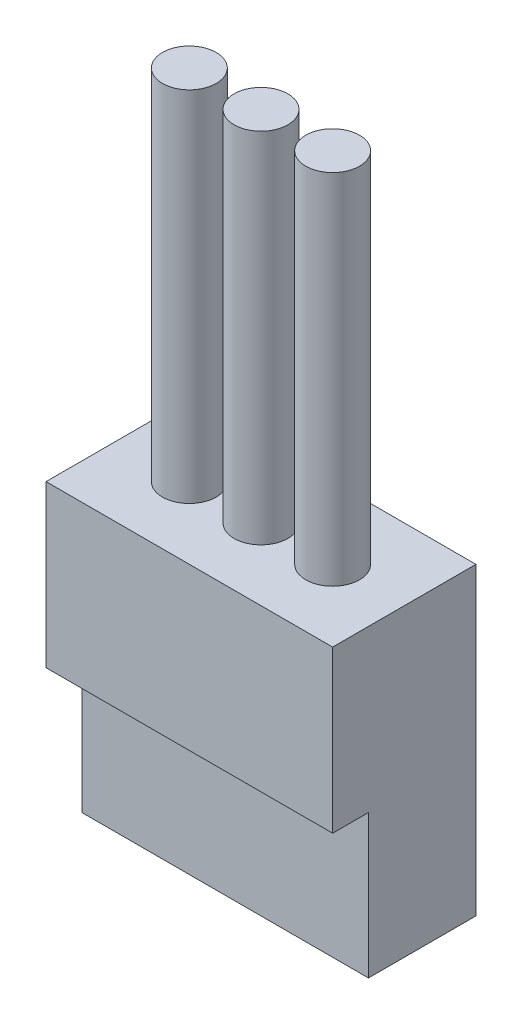
ISO-10303-21;
HEADER;
FILE_DESCRIPTION(('STEP AP214'),'2;1');
FILE_NAME('part.step','',(''),(''),'','','');
FILE_SCHEMA(('AUTOMOTIVE_DESIGN { 1 0 10303 214 1 1 1 1 }'));
ENDSEC;
DATA;
#1=APPLICATION_CONTEXT('core data for automotive mechanical design processes');
#2=APPLICATION_PROTOCOL_DEFINITION('international standard','automotive_design',2000,#1);
#3=PRODUCT_CONTEXT('',#1,'mechanical');
#4=PRODUCT('Part','Part','',(#3));
#5=PRODUCT_RELATED_PRODUCT_CATEGORY('part','',(#4));
#6=PRODUCT_DEFINITION_FORMATION('','',#4);
#7=PRODUCT_DEFINITION_CONTEXT('part definition',#1,'design');
#8=PRODUCT_DEFINITION('design','',#6,#7);
#9=PRODUCT_DEFINITION_SHAPE('','',#8);
#10=(LENGTH_UNIT() NAMED_UNIT(*) SI_UNIT(.MILLI.,.METRE.));
#11=(NAMED_UNIT(*) PLANE_ANGLE_UNIT() SI_UNIT($,.RADIAN.));
#12=(NAMED_UNIT(*) SI_UNIT($,.STERADIAN.) SOLID_ANGLE_UNIT());
#13=UNCERTAINTY_MEASURE_WITH_UNIT(LENGTH_MEASURE(1.E-05),#10,'distance_accuracy_value','');
#14=(GEOMETRIC_REPRESENTATION_CONTEXT(3) GLOBAL_UNCERTAINTY_ASSIGNED_CONTEXT((#13)) GLOBAL_UNIT_ASSIGNED_CONTEXT((#10,
#11,#12)) REPRESENTATION_CONTEXT('',''));
#15=CARTESIAN_POINT('',(0.,0.,0.));
#16=DIRECTION('',(0.,0.,1.));
#17=DIRECTION('',(1.,0.,0.));
#18=AXIS2_PLACEMENT_3D('',#15,#16,#17);
#19=CARTESIAN_POINT('',(0.,8.5,4.));
#20=DIRECTION('',(0.,1.,0.));
#21=DIRECTION('',(0.,0.,1.));
#22=AXIS2_PLACEMENT_3D('',#19,#20,#21);
#23=PLANE('',#22);
#24=CARTESIAN_POINT('',(2.,8.5,2.));
#25=DIRECTION('',(0.,1.,0.));
#26=DIRECTION('',(0.,0.,1.));
#27=AXIS2_PLACEMENT_3D('',#24,#25,#26);
#28=CIRCLE('',#27,0.75);
#29=CARTESIAN_POINT('',(2.,8.5,2.75));
#30=VERTEX_POINT('',#29);
#31=EDGE_CURVE('E160',#30,#30,#28,.T.);
#32=ORIENTED_EDGE('',*,*,#31,.F.);
#33=EDGE_LOOP('',(#32));
#34=FACE_BOUND('',#33,.T.);
#35=DIRECTION('',(0.,0.,1.));
#36=VECTOR('',#35,1.);
#37=CARTESIAN_POINT('',(0.,8.5,0.));
#38=LINE('',#37,#36);
#39=CARTESIAN_POINT('',(0.,8.5,0.));
#40=VERTEX_POINT('',#39);
#41=CARTESIAN_POINT('',(0.,8.5,4.));
#42=VERTEX_POINT('',#41);
#43=EDGE_CURVE('E113',#40,#42,#38,.T.);
#44=ORIENTED_EDGE('',*,*,#43,.T.);
#45=DIRECTION('',(1.,0.,0.));
#46=VECTOR('',#45,1.);
#47=CARTESIAN_POINT('',(0.,8.5,4.));
#48=LINE('',#47,#46);
#49=CARTESIAN_POINT('',(8.,8.5,4.));
#50=VERTEX_POINT('',#49);
#51=EDGE_CURVE('E124',#42,#50,#48,.T.);
#52=ORIENTED_EDGE('',*,*,#51,.T.);
#53=DIRECTION('',(0.,0.,-1.));
#54=VECTOR('',#53,1.);
#55=CARTESIAN_POINT('',(8.,8.5,0.));
#56=LINE('',#55,#54);
#57=CARTESIAN_POINT('',(8.,8.5,0.));
#58=VERTEX_POINT('',#57);
#59=EDGE_CURVE('E119',#50,#58,#56,.T.);
#60=ORIENTED_EDGE('',*,*,#59,.T.);
#61=DIRECTION('',(-1.,0.,0.));
#62=VECTOR('',#61,1.);
#63=CARTESIAN_POINT('',(0.,8.5,0.));
#64=LINE('',#63,#62);
#65=EDGE_CURVE('E83',#58,#40,#64,.T.);
#66=ORIENTED_EDGE('',*,*,#65,.T.);
#67=EDGE_LOOP('',(#44,#52,#60,#66));
#68=FACE_BOUND('',#67,.T.);
#69=CARTESIAN_POINT('',(4.,8.5,2.));
#70=DIRECTION('',(0.,1.,0.));
#71=DIRECTION('',(0.,0.,1.));
#72=AXIS2_PLACEMENT_3D('',#69,#70,#71);
#73=CIRCLE('',#72,0.75);
#74=CARTESIAN_POINT('',(4.,8.5,2.75));
#75=VERTEX_POINT('',#74);
#76=EDGE_CURVE('E154',#75,#75,#73,.T.);
#77=ORIENTED_EDGE('',*,*,#76,.F.);
#78=EDGE_LOOP('',(#77));
#79=FACE_BOUND('',#78,.T.);
#80=CARTESIAN_POINT('',(6.,8.5,2.));
#81=DIRECTION('',(0.,1.,0.));
#82=DIRECTION('',(0.,0.,-1.));
#83=AXIS2_PLACEMENT_3D('',#80,#81,#82);
#84=CIRCLE('',#83,0.749999999999998);
#85=CARTESIAN_POINT('',(6.,8.5,1.25));
#86=VERTEX_POINT('',#85);
#87=EDGE_CURVE('E166',#86,#86,#84,.T.);
#88=ORIENTED_EDGE('',*,*,#87,.F.);
#89=EDGE_LOOP('',(#88));
#90=FACE_BOUND('',#89,.T.);
#91=ADVANCED_FACE('F30',(#34,#68,#79,#90),#23,.T.);
#92=CARTESIAN_POINT('',(0.,4.,3.));
#93=DIRECTION('',(1.,0.,0.));
#94=DIRECTION('',(0.,0.,-1.));
#95=AXIS2_PLACEMENT_3D('',#92,#93,#94);
#96=PLANE('',#95);
#97=DIRECTION('',(0.,0.,1.));
#98=VECTOR('',#97,1.);
#99=CARTESIAN_POINT('',(0.,0.,3.));
#100=LINE('',#99,#98);
#101=CARTESIAN_POINT('',(0.,0.,0.));
#102=VERTEX_POINT('',#101);
#103=CARTESIAN_POINT('',(0.,0.,3.));
#104=VERTEX_POINT('',#103);
#105=EDGE_CURVE('E89',#102,#104,#100,.T.);
#106=ORIENTED_EDGE('',*,*,#105,.T.);
#107=DIRECTION('',(0.,-1.,0.));
#108=VECTOR('',#107,1.);
#109=CARTESIAN_POINT('',(0.,4.,3.));
#110=LINE('',#109,#108);
#111=CARTESIAN_POINT('',(0.,4.,3.));
#112=VERTEX_POINT('',#111);
#113=EDGE_CURVE('E11',#112,#104,#110,.T.);
#114=ORIENTED_EDGE('',*,*,#113,.F.);
#115=DIRECTION('',(0.,0.,1.));
#116=VECTOR('',#115,1.);
#117=CARTESIAN_POINT('',(0.,4.,0.));
#118=LINE('',#117,#116);
#119=CARTESIAN_POINT('',(0.,4.,4.));
#120=VERTEX_POINT('',#119);
#121=EDGE_CURVE('E131',#112,#120,#118,.T.);
#122=ORIENTED_EDGE('',*,*,#121,.T.);
#123=DIRECTION('',(0.,-1.,0.));
#124=VECTOR('',#123,1.);
#125=CARTESIAN_POINT('',(0.,8.5,4.));
#126=LINE('',#125,#124);
#127=EDGE_CURVE('E104',#42,#120,#126,.T.);
#128=ORIENTED_EDGE('',*,*,#127,.F.);
#129=ORIENTED_EDGE('',*,*,#43,.F.);
#130=DIRECTION('',(0.,-1.,0.));
#131=VECTOR('',#130,1.);
#132=CARTESIAN_POINT('',(0.,4.,0.));
#133=LINE('',#132,#131);
#134=EDGE_CURVE('E84',#40,#102,#133,.T.);
#135=ORIENTED_EDGE('',*,*,#134,.T.);
#136=EDGE_LOOP('',(#106,#114,#122,#128,#129,#135));
#137=FACE_BOUND('',#136,.T.);
#138=ADVANCED_FACE('F32',(#137),#96,.F.);
#139=CARTESIAN_POINT('',(8.,4.,3.));
#140=DIRECTION('',(0.,0.,-1.));
#141=DIRECTION('',(-1.,0.,0.));
#142=AXIS2_PLACEMENT_3D('',#139,#140,#141);
#143=PLANE('',#142);
#144=DIRECTION('',(1.,0.,0.));
#145=VECTOR('',#144,1.);
#146=CARTESIAN_POINT('',(8.,0.,3.));
#147=LINE('',#146,#145);
#148=CARTESIAN_POINT('',(8.,0.,3.));
#149=VERTEX_POINT('',#148);
#150=EDGE_CURVE('E75',#104,#149,#147,.T.);
#151=ORIENTED_EDGE('',*,*,#150,.T.);
#152=DIRECTION('',(0.,-1.,0.));
#153=VECTOR('',#152,1.);
#154=CARTESIAN_POINT('',(8.,4.,3.));
#155=LINE('',#154,#153);
#156=CARTESIAN_POINT('',(8.,4.,3.));
#157=VERTEX_POINT('',#156);
#158=EDGE_CURVE('E40',#157,#149,#155,.T.);
#159=ORIENTED_EDGE('',*,*,#158,.F.);
#160=DIRECTION('',(1.,0.,0.));
#161=VECTOR('',#160,1.);
#162=CARTESIAN_POINT('',(8.,4.,3.));
#163=LINE('',#162,#161);
#164=EDGE_CURVE('E46',#112,#157,#163,.T.);
#165=ORIENTED_EDGE('',*,*,#164,.F.);
#166=ORIENTED_EDGE('',*,*,#113,.T.);
#167=EDGE_LOOP('',(#151,#159,#165,#166));
#168=FACE_BOUND('',#167,.T.);
#169=ADVANCED_FACE('F105',(#168),#143,.F.);
#170=CARTESIAN_POINT('',(8.,4.,0.));
#171=DIRECTION('',(-1.,0.,0.));
#172=DIRECTION('',(0.,0.,1.));
#173=AXIS2_PLACEMENT_3D('',#170,#171,#172);
#174=PLANE('',#173);
#175=DIRECTION('',(0.,0.,-1.));
#176=VECTOR('',#175,1.);
#177=CARTESIAN_POINT('',(8.,0.,0.));
#178=LINE('',#177,#176);
#179=CARTESIAN_POINT('',(8.,0.,0.));
#180=VERTEX_POINT('',#179);
#181=EDGE_CURVE('E64',#149,#180,#178,.T.);
#182=ORIENTED_EDGE('',*,*,#181,.T.);
#183=DIRECTION('',(0.,-1.,0.));
#184=VECTOR('',#183,1.);
#185=CARTESIAN_POINT('',(8.,4.,0.));
#186=LINE('',#185,#184);
#187=EDGE_CURVE('E69',#58,#180,#186,.T.);
#188=ORIENTED_EDGE('',*,*,#187,.F.);
#189=ORIENTED_EDGE('',*,*,#59,.F.);
#190=DIRECTION('',(0.,-1.,0.));
#191=VECTOR('',#190,1.);
#192=CARTESIAN_POINT('',(8.,8.5,4.));
#193=LINE('',#192,#191);
#194=CARTESIAN_POINT('',(8.,4.,4.));
#195=VERTEX_POINT('',#194);
#196=EDGE_CURVE('E120',#50,#195,#193,.T.);
#197=ORIENTED_EDGE('',*,*,#196,.T.);
#198=DIRECTION('',(0.,0.,-1.));
#199=VECTOR('',#198,1.);
#200=CARTESIAN_POINT('',(8.,4.,0.));
#201=LINE('',#200,#199);
#202=EDGE_CURVE('E101',#195,#157,#201,.T.);
#203=ORIENTED_EDGE('',*,*,#202,.T.);
#204=ORIENTED_EDGE('',*,*,#158,.T.);
#205=EDGE_LOOP('',(#182,#188,#189,#197,#203,#204));
#206=FACE_BOUND('',#205,.T.);
#207=ADVANCED_FACE('F66',(#206),#174,.F.);
#208=CARTESIAN_POINT('',(0.,4.,0.));
#209=DIRECTION('',(0.,0.,1.));
#210=DIRECTION('',(1.,0.,0.));
#211=AXIS2_PLACEMENT_3D('',#208,#209,#210);
#212=PLANE('',#211);
#213=DIRECTION('',(-1.,0.,0.));
#214=VECTOR('',#213,1.);
#215=CARTESIAN_POINT('',(0.,0.,0.));
#216=LINE('',#215,#214);
#217=EDGE_CURVE('E74',#180,#102,#216,.T.);
#218=ORIENTED_EDGE('',*,*,#217,.T.);
#219=ORIENTED_EDGE('',*,*,#134,.F.);
#220=ORIENTED_EDGE('',*,*,#65,.F.);
#221=ORIENTED_EDGE('',*,*,#187,.T.);
#222=EDGE_LOOP('',(#218,#219,#220,#221));
#223=FACE_BOUND('',#222,.T.);
#224=ADVANCED_FACE('F79',(#223),#212,.F.);
#225=CARTESIAN_POINT('',(0.,0.,0.));
#226=DIRECTION('',(0.,-1.,0.));
#227=DIRECTION('',(0.,0.,-1.));
#228=AXIS2_PLACEMENT_3D('',#225,#226,#227);
#229=PLANE('',#228);
#230=ORIENTED_EDGE('',*,*,#105,.F.);
#231=ORIENTED_EDGE('',*,*,#217,.F.);
#232=ORIENTED_EDGE('',*,*,#181,.F.);
#233=ORIENTED_EDGE('',*,*,#150,.F.);
#234=EDGE_LOOP('',(#230,#231,#232,#233));
#235=FACE_BOUND('',#234,.T.);
#236=ADVANCED_FACE('F87',(#235),#229,.T.);
#237=CARTESIAN_POINT('',(0.,4.,4.));
#238=DIRECTION('',(0.,1.,0.));
#239=DIRECTION('',(0.,0.,1.));
#240=AXIS2_PLACEMENT_3D('',#237,#238,#239);
#241=PLANE('',#240);
#242=ORIENTED_EDGE('',*,*,#121,.F.);
#243=ORIENTED_EDGE('',*,*,#164,.T.);
#244=ORIENTED_EDGE('',*,*,#202,.F.);
#245=DIRECTION('',(1.,0.,0.));
#246=VECTOR('',#245,1.);
#247=CARTESIAN_POINT('',(0.,4.,4.));
#248=LINE('',#247,#246);
#249=EDGE_CURVE('E130',#120,#195,#248,.T.);
#250=ORIENTED_EDGE('',*,*,#249,.F.);
#251=EDGE_LOOP('',(#242,#243,#244,#250));
#252=FACE_BOUND('',#251,.T.);
#253=ADVANCED_FACE('F151',(#252),#241,.F.);
#254=CARTESIAN_POINT('',(0.,8.5,4.));
#255=DIRECTION('',(0.,0.,-1.));
#256=DIRECTION('',(-1.,0.,0.));
#257=AXIS2_PLACEMENT_3D('',#254,#255,#256);
#258=PLANE('',#257);
#259=ORIENTED_EDGE('',*,*,#249,.T.);
#260=ORIENTED_EDGE('',*,*,#196,.F.);
#261=ORIENTED_EDGE('',*,*,#51,.F.);
#262=ORIENTED_EDGE('',*,*,#127,.T.);
#263=EDGE_LOOP('',(#259,#260,#261,#262));
#264=FACE_BOUND('',#263,.T.);
#265=ADVANCED_FACE('F140',(#264),#258,.F.);
#266=CARTESIAN_POINT('',(4.,18.5,2.));
#267=DIRECTION('',(0.,-1.,0.));
#268=DIRECTION('',(0.,0.,-1.));
#269=AXIS2_PLACEMENT_3D('',#266,#267,#268);
#270=CYLINDRICAL_SURFACE('',#269,0.75);
#271=CARTESIAN_POINT('',(4.,18.5,2.));
#272=DIRECTION('',(0.,1.,0.));
#273=DIRECTION('',(0.,0.,1.));
#274=AXIS2_PLACEMENT_3D('',#271,#272,#273);
#275=CIRCLE('',#274,0.75);
#276=CARTESIAN_POINT('',(4.,18.5,2.75));
#277=VERTEX_POINT('',#276);
#278=EDGE_CURVE('E133',#277,#277,#275,.T.);
#279=ORIENTED_EDGE('',*,*,#278,.F.);
#280=EDGE_LOOP('',(#279));
#281=FACE_BOUND('',#280,.T.);
#282=ORIENTED_EDGE('',*,*,#76,.T.);
#283=EDGE_LOOP('',(#282));
#284=FACE_BOUND('',#283,.T.);
#285=ADVANCED_FACE('F190',(#281,#284),#270,.T.);
#286=CARTESIAN_POINT('',(4.,18.5,2.));
#287=DIRECTION('',(0.,1.,0.));
#288=DIRECTION('',(0.,0.,1.));
#289=AXIS2_PLACEMENT_3D('',#286,#287,#288);
#290=PLANE('',#289);
#291=ORIENTED_EDGE('',*,*,#278,.T.);
#292=EDGE_LOOP('',(#291));
#293=FACE_BOUND('',#292,.T.);
#294=ADVANCED_FACE('F232',(#293),#290,.T.);
#295=CARTESIAN_POINT('',(2.,18.5,2.));
#296=DIRECTION('',(0.,-1.,0.));
#297=DIRECTION('',(0.,0.,-1.));
#298=AXIS2_PLACEMENT_3D('',#295,#296,#297);
#299=CYLINDRICAL_SURFACE('',#298,0.75);
#300=CARTESIAN_POINT('',(2.,18.5,2.));
#301=DIRECTION('',(0.,1.,0.));
#302=DIRECTION('',(0.,0.,1.));
#303=AXIS2_PLACEMENT_3D('',#300,#301,#302);
#304=CIRCLE('',#303,0.75);
#305=CARTESIAN_POINT('',(2.,18.5,2.75));
#306=VERTEX_POINT('',#305);
#307=EDGE_CURVE('E157',#306,#306,#304,.T.);
#308=ORIENTED_EDGE('',*,*,#307,.F.);
#309=EDGE_LOOP('',(#308));
#310=FACE_BOUND('',#309,.T.);
#311=ORIENTED_EDGE('',*,*,#31,.T.);
#312=EDGE_LOOP('',(#311));
#313=FACE_BOUND('',#312,.T.);
#314=ADVANCED_FACE('F239',(#310,#313),#299,.T.);
#315=CARTESIAN_POINT('',(2.,18.5,2.));
#316=DIRECTION('',(0.,1.,0.));
#317=DIRECTION('',(0.,0.,1.));
#318=AXIS2_PLACEMENT_3D('',#315,#316,#317);
#319=PLANE('',#318);
#320=ORIENTED_EDGE('',*,*,#307,.T.);
#321=EDGE_LOOP('',(#320));
#322=FACE_BOUND('',#321,.T.);
#323=ADVANCED_FACE('F177',(#322),#319,.T.);
#324=CARTESIAN_POINT('',(6.,18.5,2.));
#325=DIRECTION('',(0.,-1.,0.));
#326=DIRECTION('',(0.,0.,-1.));
#327=AXIS2_PLACEMENT_3D('',#324,#325,#326);
#328=CYLINDRICAL_SURFACE('',#327,0.749999999999998);
#329=CARTESIAN_POINT('',(6.,18.5,2.));
#330=DIRECTION('',(0.,1.,0.));
#331=DIRECTION('',(0.,0.,-1.));
#332=AXIS2_PLACEMENT_3D('',#329,#330,#331);
#333=CIRCLE('',#332,0.749999999999998);
#334=CARTESIAN_POINT('',(6.,18.5,1.25));
#335=VERTEX_POINT('',#334);
#336=EDGE_CURVE('E163',#335,#335,#333,.T.);
#337=ORIENTED_EDGE('',*,*,#336,.F.);
#338=EDGE_LOOP('',(#337));
#339=FACE_BOUND('',#338,.T.);
#340=ORIENTED_EDGE('',*,*,#87,.T.);
#341=EDGE_LOOP('',(#340));
#342=FACE_BOUND('',#341,.T.);
#343=ADVANCED_FACE('F174',(#339,#342),#328,.T.);
#344=CARTESIAN_POINT('',(6.,18.5,2.));
#345=DIRECTION('',(0.,-1.,0.));
#346=DIRECTION('',(0.,0.,-1.));
#347=AXIS2_PLACEMENT_3D('',#344,#345,#346);
#348=PLANE('',#347);
#349=ORIENTED_EDGE('',*,*,#336,.T.);
#350=EDGE_LOOP('',(#349));
#351=FACE_BOUND('',#350,.T.);
#352=ADVANCED_FACE('F172',(#351),#348,.F.);
#353=CLOSED_SHELL('',(#91,#138,#169,#207,#224,#236,#253,#265,#285,#294,#314,#323,#343,#352));
#354=MANIFOLD_SOLID_BREP('B2',#353);
#355=ADVANCED_BREP_SHAPE_REPRESENTATION('',(#18,#354),#14);
#356=SHAPE_DEFINITION_REPRESENTATION(#9,#355);
ENDSEC;
END-ISO-10303-21;
